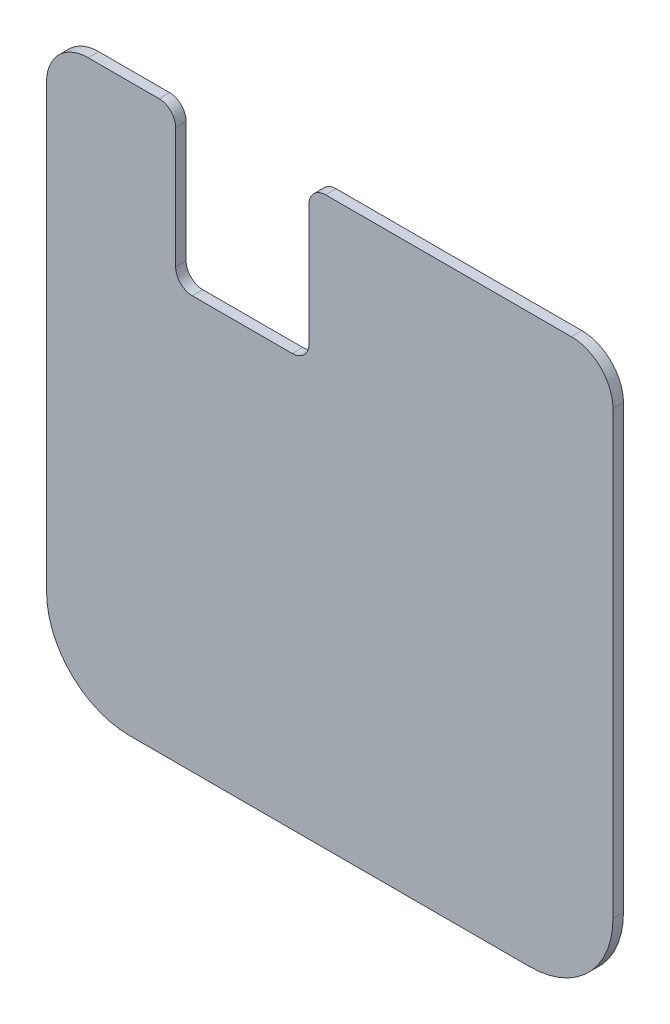
ISO-10303-21;
HEADER;
FILE_DESCRIPTION(('STEP AP214'),'2;1');
FILE_NAME('part.step','',(''),(''),'','','');
FILE_SCHEMA(('AUTOMOTIVE_DESIGN { 1 0 10303 214 1 1 1 1 }'));
ENDSEC;
DATA;
#1=APPLICATION_CONTEXT('core data for automotive mechanical design processes');
#2=APPLICATION_PROTOCOL_DEFINITION('international standard','automotive_design',2000,#1);
#3=PRODUCT_CONTEXT('',#1,'mechanical');
#4=PRODUCT('Part','Part','',(#3));
#5=PRODUCT_RELATED_PRODUCT_CATEGORY('part','',(#4));
#6=PRODUCT_DEFINITION_FORMATION('','',#4);
#7=PRODUCT_DEFINITION_CONTEXT('part definition',#1,'design');
#8=PRODUCT_DEFINITION('design','',#6,#7);
#9=PRODUCT_DEFINITION_SHAPE('','',#8);
#10=(LENGTH_UNIT() NAMED_UNIT(*) SI_UNIT(.MILLI.,.METRE.));
#11=(NAMED_UNIT(*) PLANE_ANGLE_UNIT() SI_UNIT($,.RADIAN.));
#12=(NAMED_UNIT(*) SI_UNIT($,.STERADIAN.) SOLID_ANGLE_UNIT());
#13=UNCERTAINTY_MEASURE_WITH_UNIT(LENGTH_MEASURE(1.E-05),#10,'distance_accuracy_value','');
#14=(GEOMETRIC_REPRESENTATION_CONTEXT(3) GLOBAL_UNCERTAINTY_ASSIGNED_CONTEXT((#13)) GLOBAL_UNIT_ASSIGNED_CONTEXT((#10,
#11,#12)) REPRESENTATION_CONTEXT('',''));
#15=CARTESIAN_POINT('',(0.,0.,0.));
#16=DIRECTION('',(0.,0.,1.));
#17=DIRECTION('',(1.,0.,0.));
#18=AXIS2_PLACEMENT_3D('',#15,#16,#17);
#19=CARTESIAN_POINT('',(44.1452,-26.01468,1.6002));
#20=DIRECTION('',(0.,0.,-1.));
#21=DIRECTION('',(-1.,0.,0.));
#22=AXIS2_PLACEMENT_3D('',#19,#20,#21);
#23=CYLINDRICAL_SURFACE('',#22,6.35);
#24=CARTESIAN_POINT('',(44.1452,-26.01468,0.));
#25=DIRECTION('',(0.,0.,1.));
#26=DIRECTION('',(1.,0.,0.));
#27=AXIS2_PLACEMENT_3D('',#24,#25,#26);
#28=CIRCLE('',#27,6.35);
#29=CARTESIAN_POINT('',(44.1452,-19.66468,0.));
#30=VERTEX_POINT('',#29);
#31=CARTESIAN_POINT('',(37.7952,-26.01468,0.));
#32=VERTEX_POINT('',#31);
#33=EDGE_CURVE('E180',#30,#32,#28,.T.);
#34=ORIENTED_EDGE('',*,*,#33,.T.);
#35=DIRECTION('',(0.,0.,-1.));
#36=VECTOR('',#35,1.);
#37=CARTESIAN_POINT('',(37.7952,-26.01468,1.6002));
#38=LINE('',#37,#36);
#39=CARTESIAN_POINT('',(37.7952,-26.01468,1.6002));
#40=VERTEX_POINT('',#39);
#41=EDGE_CURVE('E11',#40,#32,#38,.T.);
#42=ORIENTED_EDGE('',*,*,#41,.F.);
#43=CARTESIAN_POINT('',(44.1452,-26.01468,1.6002));
#44=DIRECTION('',(0.,0.,1.));
#45=DIRECTION('',(1.,0.,0.));
#46=AXIS2_PLACEMENT_3D('',#43,#44,#45);
#47=CIRCLE('',#46,6.35);
#48=CARTESIAN_POINT('',(44.1452,-19.66468,1.6002));
#49=VERTEX_POINT('',#48);
#50=EDGE_CURVE('E210',#49,#40,#47,.T.);
#51=ORIENTED_EDGE('',*,*,#50,.F.);
#52=DIRECTION('',(0.,0.,-1.));
#53=VECTOR('',#52,1.);
#54=CARTESIAN_POINT('',(44.1452,-19.66468,1.6002));
#55=LINE('',#54,#53);
#56=EDGE_CURVE('E176',#49,#30,#55,.T.);
#57=ORIENTED_EDGE('',*,*,#56,.T.);
#58=EDGE_LOOP('',(#34,#42,#51,#57));
#59=FACE_BOUND('',#58,.T.);
#60=ADVANCED_FACE('F36',(#59),#23,.T.);
#61=CARTESIAN_POINT('',(37.7952,-26.01468,1.6002));
#62=DIRECTION('',(1.,0.,0.));
#63=DIRECTION('',(0.,0.,-1.));
#64=AXIS2_PLACEMENT_3D('',#61,#62,#63);
#65=PLANE('',#64);
#66=DIRECTION('',(0.,-1.,0.));
#67=VECTOR('',#66,1.);
#68=CARTESIAN_POINT('',(37.7952,-26.01468,0.));
#69=LINE('',#68,#67);
#70=CARTESIAN_POINT('',(37.7952,-93.32468,0.));
#71=VERTEX_POINT('',#70);
#72=EDGE_CURVE('E183',#32,#71,#69,.T.);
#73=ORIENTED_EDGE('',*,*,#72,.T.);
#74=DIRECTION('',(0.,0.,-1.));
#75=VECTOR('',#74,1.);
#76=CARTESIAN_POINT('',(37.7952,-93.32468,1.6002));
#77=LINE('',#76,#75);
#78=CARTESIAN_POINT('',(37.7952,-93.32468,1.6002));
#79=VERTEX_POINT('',#78);
#80=EDGE_CURVE('E44',#79,#71,#77,.T.);
#81=ORIENTED_EDGE('',*,*,#80,.F.);
#82=DIRECTION('',(0.,-1.,0.));
#83=VECTOR('',#82,1.);
#84=CARTESIAN_POINT('',(37.7952,-26.01468,1.6002));
#85=LINE('',#84,#83);
#86=EDGE_CURVE('E119',#40,#79,#85,.T.);
#87=ORIENTED_EDGE('',*,*,#86,.F.);
#88=ORIENTED_EDGE('',*,*,#41,.T.);
#89=EDGE_LOOP('',(#73,#81,#87,#88));
#90=FACE_BOUND('',#89,.T.);
#91=ADVANCED_FACE('F308',(#90),#65,.F.);
#92=CARTESIAN_POINT('',(50.4952,-93.32468,1.6002));
#93=DIRECTION('',(0.,0.,-1.));
#94=DIRECTION('',(-1.,0.,0.));
#95=AXIS2_PLACEMENT_3D('',#92,#93,#94);
#96=CYLINDRICAL_SURFACE('',#95,12.7);
#97=CARTESIAN_POINT('',(50.4952,-93.32468,0.));
#98=DIRECTION('',(0.,0.,1.));
#99=DIRECTION('',(1.,0.,0.));
#100=AXIS2_PLACEMENT_3D('',#97,#98,#99);
#101=CIRCLE('',#100,12.7);
#102=CARTESIAN_POINT('',(50.4952,-106.02468,0.));
#103=VERTEX_POINT('',#102);
#104=EDGE_CURVE('E185',#71,#103,#101,.T.);
#105=ORIENTED_EDGE('',*,*,#104,.T.);
#106=DIRECTION('',(0.,0.,-1.));
#107=VECTOR('',#106,1.);
#108=CARTESIAN_POINT('',(50.4952,-106.02468,1.6002));
#109=LINE('',#108,#107);
#110=CARTESIAN_POINT('',(50.4952,-106.02468,1.6002));
#111=VERTEX_POINT('',#110);
#112=EDGE_CURVE('E241',#111,#103,#109,.T.);
#113=ORIENTED_EDGE('',*,*,#112,.F.);
#114=CARTESIAN_POINT('',(50.4952,-93.32468,1.6002));
#115=DIRECTION('',(0.,0.,1.));
#116=DIRECTION('',(1.,0.,0.));
#117=AXIS2_PLACEMENT_3D('',#114,#115,#116);
#118=CIRCLE('',#117,12.7);
#119=EDGE_CURVE('E249',#79,#111,#118,.T.);
#120=ORIENTED_EDGE('',*,*,#119,.F.);
#121=ORIENTED_EDGE('',*,*,#80,.T.);
#122=EDGE_LOOP('',(#105,#113,#120,#121));
#123=FACE_BOUND('',#122,.T.);
#124=ADVANCED_FACE('F247',(#123),#96,.T.);
#125=CARTESIAN_POINT('',(50.4952,-106.02468,1.6002));
#126=DIRECTION('',(0.,1.,0.));
#127=DIRECTION('',(0.,0.,1.));
#128=AXIS2_PLACEMENT_3D('',#125,#126,#127);
#129=PLANE('',#128);
#130=DIRECTION('',(1.,0.,0.));
#131=VECTOR('',#130,1.);
#132=CARTESIAN_POINT('',(50.4952,-106.02468,0.));
#133=LINE('',#132,#131);
#134=CARTESIAN_POINT('',(111.4552,-106.02468,0.));
#135=VERTEX_POINT('',#134);
#136=EDGE_CURVE('E187',#103,#135,#133,.T.);
#137=ORIENTED_EDGE('',*,*,#136,.T.);
#138=DIRECTION('',(0.,0.,-1.));
#139=VECTOR('',#138,1.);
#140=CARTESIAN_POINT('',(111.4552,-106.02468,1.6002));
#141=LINE('',#140,#139);
#142=CARTESIAN_POINT('',(111.4552,-106.02468,1.6002));
#143=VERTEX_POINT('',#142);
#144=EDGE_CURVE('E238',#143,#135,#141,.T.);
#145=ORIENTED_EDGE('',*,*,#144,.F.);
#146=DIRECTION('',(1.,0.,0.));
#147=VECTOR('',#146,1.);
#148=CARTESIAN_POINT('',(50.4952,-106.02468,1.6002));
#149=LINE('',#148,#147);
#150=EDGE_CURVE('E267',#111,#143,#149,.T.);
#151=ORIENTED_EDGE('',*,*,#150,.F.);
#152=ORIENTED_EDGE('',*,*,#112,.T.);
#153=EDGE_LOOP('',(#137,#145,#151,#152));
#154=FACE_BOUND('',#153,.T.);
#155=ADVANCED_FACE('F258',(#154),#129,.F.);
#156=CARTESIAN_POINT('',(111.4552,-93.32468,1.6002));
#157=DIRECTION('',(0.,0.,-1.));
#158=DIRECTION('',(-1.,0.,0.));
#159=AXIS2_PLACEMENT_3D('',#156,#157,#158);
#160=CYLINDRICAL_SURFACE('',#159,12.7);
#161=CARTESIAN_POINT('',(111.4552,-93.32468,0.));
#162=DIRECTION('',(0.,0.,1.));
#163=DIRECTION('',(1.,0.,0.));
#164=AXIS2_PLACEMENT_3D('',#161,#162,#163);
#165=CIRCLE('',#164,12.7);
#166=CARTESIAN_POINT('',(124.1552,-93.32468,0.));
#167=VERTEX_POINT('',#166);
#168=EDGE_CURVE('E189',#135,#167,#165,.T.);
#169=ORIENTED_EDGE('',*,*,#168,.T.);
#170=DIRECTION('',(0.,0.,-1.));
#171=VECTOR('',#170,1.);
#172=CARTESIAN_POINT('',(124.1552,-93.32468,1.6002));
#173=LINE('',#172,#171);
#174=CARTESIAN_POINT('',(124.1552,-93.32468,1.6002));
#175=VERTEX_POINT('',#174);
#176=EDGE_CURVE('E235',#175,#167,#173,.T.);
#177=ORIENTED_EDGE('',*,*,#176,.F.);
#178=CARTESIAN_POINT('',(111.4552,-93.32468,1.6002));
#179=DIRECTION('',(0.,0.,1.));
#180=DIRECTION('',(1.,0.,0.));
#181=AXIS2_PLACEMENT_3D('',#178,#179,#180);
#182=CIRCLE('',#181,12.7);
#183=EDGE_CURVE('E264',#143,#175,#182,.T.);
#184=ORIENTED_EDGE('',*,*,#183,.F.);
#185=ORIENTED_EDGE('',*,*,#144,.T.);
#186=EDGE_LOOP('',(#169,#177,#184,#185));
#187=FACE_BOUND('',#186,.T.);
#188=ADVANCED_FACE('F262',(#187),#160,.T.);
#189=CARTESIAN_POINT('',(124.1552,-93.32468,1.6002));
#190=DIRECTION('',(-1.,0.,0.));
#191=DIRECTION('',(0.,0.,1.));
#192=AXIS2_PLACEMENT_3D('',#189,#190,#191);
#193=PLANE('',#192);
#194=DIRECTION('',(0.,1.,0.));
#195=VECTOR('',#194,1.);
#196=CARTESIAN_POINT('',(124.1552,-93.32468,0.));
#197=LINE('',#196,#195);
#198=CARTESIAN_POINT('',(124.1552,-26.01468,0.));
#199=VERTEX_POINT('',#198);
#200=EDGE_CURVE('E191',#167,#199,#197,.T.);
#201=ORIENTED_EDGE('',*,*,#200,.T.);
#202=DIRECTION('',(0.,0.,-1.));
#203=VECTOR('',#202,1.);
#204=CARTESIAN_POINT('',(124.1552,-26.01468,1.6002));
#205=LINE('',#204,#203);
#206=CARTESIAN_POINT('',(124.1552,-26.01468,1.6002));
#207=VERTEX_POINT('',#206);
#208=EDGE_CURVE('E232',#207,#199,#205,.T.);
#209=ORIENTED_EDGE('',*,*,#208,.F.);
#210=DIRECTION('',(0.,1.,0.));
#211=VECTOR('',#210,1.);
#212=CARTESIAN_POINT('',(124.1552,-93.32468,1.6002));
#213=LINE('',#212,#211);
#214=EDGE_CURVE('E266',#175,#207,#213,.T.);
#215=ORIENTED_EDGE('',*,*,#214,.F.);
#216=ORIENTED_EDGE('',*,*,#176,.T.);
#217=EDGE_LOOP('',(#201,#209,#215,#216));
#218=FACE_BOUND('',#217,.T.);
#219=ADVANCED_FACE('F321',(#218),#193,.F.);
#220=CARTESIAN_POINT('',(117.8052,-26.01468,1.6002));
#221=DIRECTION('',(0.,0.,-1.));
#222=DIRECTION('',(-1.,0.,0.));
#223=AXIS2_PLACEMENT_3D('',#220,#221,#222);
#224=CYLINDRICAL_SURFACE('',#223,6.35);
#225=CARTESIAN_POINT('',(117.8052,-26.01468,0.));
#226=DIRECTION('',(0.,0.,1.));
#227=DIRECTION('',(1.,0.,0.));
#228=AXIS2_PLACEMENT_3D('',#225,#226,#227);
#229=CIRCLE('',#228,6.35);
#230=CARTESIAN_POINT('',(117.8052,-19.66468,0.));
#231=VERTEX_POINT('',#230);
#232=EDGE_CURVE('E193',#199,#231,#229,.T.);
#233=ORIENTED_EDGE('',*,*,#232,.T.);
#234=DIRECTION('',(0.,0.,-1.));
#235=VECTOR('',#234,1.);
#236=CARTESIAN_POINT('',(117.8052,-19.66468,1.6002));
#237=LINE('',#236,#235);
#238=CARTESIAN_POINT('',(117.8052,-19.66468,1.6002));
#239=VERTEX_POINT('',#238);
#240=EDGE_CURVE('E229',#239,#231,#237,.T.);
#241=ORIENTED_EDGE('',*,*,#240,.F.);
#242=CARTESIAN_POINT('',(117.8052,-26.01468,1.6002));
#243=DIRECTION('',(0.,0.,1.));
#244=DIRECTION('',(1.,0.,0.));
#245=AXIS2_PLACEMENT_3D('',#242,#243,#244);
#246=CIRCLE('',#245,6.35);
#247=EDGE_CURVE('E269',#207,#239,#246,.T.);
#248=ORIENTED_EDGE('',*,*,#247,.F.);
#249=ORIENTED_EDGE('',*,*,#208,.T.);
#250=EDGE_LOOP('',(#233,#241,#248,#249));
#251=FACE_BOUND('',#250,.T.);
#252=ADVANCED_FACE('F324',(#251),#224,.T.);
#253=CARTESIAN_POINT('',(117.8052,-19.66468,1.6002));
#254=DIRECTION('',(0.,-1.,0.));
#255=DIRECTION('',(0.,0.,-1.));
#256=AXIS2_PLACEMENT_3D('',#253,#254,#255);
#257=PLANE('',#256);
#258=DIRECTION('',(-1.,0.,0.));
#259=VECTOR('',#258,1.);
#260=CARTESIAN_POINT('',(117.8052,-19.66468,0.));
#261=LINE('',#260,#259);
#262=CARTESIAN_POINT('',(80.3402,-19.66468,0.));
#263=VERTEX_POINT('',#262);
#264=EDGE_CURVE('E195',#231,#263,#261,.T.);
#265=ORIENTED_EDGE('',*,*,#264,.T.);
#266=DIRECTION('',(0.,0.,-1.));
#267=VECTOR('',#266,1.);
#268=CARTESIAN_POINT('',(80.3402,-19.66468,1.6002));
#269=LINE('',#268,#267);
#270=CARTESIAN_POINT('',(80.3402,-19.66468,1.6002));
#271=VERTEX_POINT('',#270);
#272=EDGE_CURVE('E226',#271,#263,#269,.T.);
#273=ORIENTED_EDGE('',*,*,#272,.F.);
#274=DIRECTION('',(-1.,0.,0.));
#275=VECTOR('',#274,1.);
#276=CARTESIAN_POINT('',(117.8052,-19.66468,1.6002));
#277=LINE('',#276,#275);
#278=EDGE_CURVE('E275',#239,#271,#277,.T.);
#279=ORIENTED_EDGE('',*,*,#278,.F.);
#280=ORIENTED_EDGE('',*,*,#240,.T.);
#281=EDGE_LOOP('',(#265,#273,#279,#280));
#282=FACE_BOUND('',#281,.T.);
#283=ADVANCED_FACE('F328',(#282),#257,.F.);
#284=CARTESIAN_POINT('',(80.3402,-22.20468,1.6002));
#285=DIRECTION('',(0.,0.,-1.));
#286=DIRECTION('',(-1.,0.,0.));
#287=AXIS2_PLACEMENT_3D('',#284,#285,#286);
#288=CYLINDRICAL_SURFACE('',#287,2.54);
#289=CARTESIAN_POINT('',(80.3402,-22.20468,0.));
#290=DIRECTION('',(0.,0.,1.));
#291=DIRECTION('',(1.,0.,0.));
#292=AXIS2_PLACEMENT_3D('',#289,#290,#291);
#293=CIRCLE('',#292,2.54);
#294=CARTESIAN_POINT('',(77.8002,-22.20468,0.));
#295=VERTEX_POINT('',#294);
#296=EDGE_CURVE('E197',#263,#295,#293,.T.);
#297=ORIENTED_EDGE('',*,*,#296,.T.);
#298=DIRECTION('',(0.,0.,-1.));
#299=VECTOR('',#298,1.);
#300=CARTESIAN_POINT('',(77.8002,-22.20468,1.6002));
#301=LINE('',#300,#299);
#302=CARTESIAN_POINT('',(77.8002,-22.20468,1.6002));
#303=VERTEX_POINT('',#302);
#304=EDGE_CURVE('E223',#303,#295,#301,.T.);
#305=ORIENTED_EDGE('',*,*,#304,.F.);
#306=CARTESIAN_POINT('',(80.3402,-22.20468,1.6002));
#307=DIRECTION('',(0.,0.,1.));
#308=DIRECTION('',(1.,0.,0.));
#309=AXIS2_PLACEMENT_3D('',#306,#307,#308);
#310=CIRCLE('',#309,2.54);
#311=EDGE_CURVE('E277',#271,#303,#310,.T.);
#312=ORIENTED_EDGE('',*,*,#311,.F.);
#313=ORIENTED_EDGE('',*,*,#272,.T.);
#314=EDGE_LOOP('',(#297,#305,#312,#313));
#315=FACE_BOUND('',#314,.T.);
#316=ADVANCED_FACE('F332',(#315),#288,.T.);
#317=CARTESIAN_POINT('',(77.8002,-22.20468,1.6002));
#318=DIRECTION('',(1.,0.,0.));
#319=DIRECTION('',(0.,0.,-1.));
#320=AXIS2_PLACEMENT_3D('',#317,#318,#319);
#321=PLANE('',#320);
#322=DIRECTION('',(0.,-1.,0.));
#323=VECTOR('',#322,1.);
#324=CARTESIAN_POINT('',(77.8002,-22.20468,0.));
#325=LINE('',#324,#323);
#326=CARTESIAN_POINT('',(77.8002,-40.61968,0.));
#327=VERTEX_POINT('',#326);
#328=EDGE_CURVE('E199',#295,#327,#325,.T.);
#329=ORIENTED_EDGE('',*,*,#328,.T.);
#330=DIRECTION('',(0.,0.,-1.));
#331=VECTOR('',#330,1.);
#332=CARTESIAN_POINT('',(77.8002,-40.61968,1.6002));
#333=LINE('',#332,#331);
#334=CARTESIAN_POINT('',(77.8002,-40.61968,1.6002));
#335=VERTEX_POINT('',#334);
#336=EDGE_CURVE('E220',#335,#327,#333,.T.);
#337=ORIENTED_EDGE('',*,*,#336,.F.);
#338=DIRECTION('',(0.,-1.,0.));
#339=VECTOR('',#338,1.);
#340=CARTESIAN_POINT('',(77.8002,-22.20468,1.6002));
#341=LINE('',#340,#339);
#342=EDGE_CURVE('E279',#303,#335,#341,.T.);
#343=ORIENTED_EDGE('',*,*,#342,.F.);
#344=ORIENTED_EDGE('',*,*,#304,.T.);
#345=EDGE_LOOP('',(#329,#337,#343,#344));
#346=FACE_BOUND('',#345,.T.);
#347=ADVANCED_FACE('F336',(#346),#321,.F.);
#348=CARTESIAN_POINT('',(75.2602,-40.61968,1.6002));
#349=DIRECTION('',(0.,0.,-1.));
#350=DIRECTION('',(-1.,0.,0.));
#351=AXIS2_PLACEMENT_3D('',#348,#349,#350);
#352=CYLINDRICAL_SURFACE('',#351,2.54);
#353=CARTESIAN_POINT('',(75.2602,-40.61968,0.));
#354=DIRECTION('',(0.,0.,-1.));
#355=DIRECTION('',(-1.,0.,0.));
#356=AXIS2_PLACEMENT_3D('',#353,#354,#355);
#357=CIRCLE('',#356,2.54);
#358=CARTESIAN_POINT('',(75.2602,-43.15968,0.));
#359=VERTEX_POINT('',#358);
#360=EDGE_CURVE('E201',#327,#359,#357,.T.);
#361=ORIENTED_EDGE('',*,*,#360,.T.);
#362=DIRECTION('',(0.,0.,-1.));
#363=VECTOR('',#362,1.);
#364=CARTESIAN_POINT('',(75.2602,-43.15968,1.6002));
#365=LINE('',#364,#363);
#366=CARTESIAN_POINT('',(75.2602,-43.15968,1.6002));
#367=VERTEX_POINT('',#366);
#368=EDGE_CURVE('E217',#367,#359,#365,.T.);
#369=ORIENTED_EDGE('',*,*,#368,.F.);
#370=CARTESIAN_POINT('',(75.2602,-40.61968,1.6002));
#371=DIRECTION('',(0.,0.,-1.));
#372=DIRECTION('',(-1.,0.,0.));
#373=AXIS2_PLACEMENT_3D('',#370,#371,#372);
#374=CIRCLE('',#373,2.54);
#375=EDGE_CURVE('E281',#335,#367,#374,.T.);
#376=ORIENTED_EDGE('',*,*,#375,.F.);
#377=ORIENTED_EDGE('',*,*,#336,.T.);
#378=EDGE_LOOP('',(#361,#369,#376,#377));
#379=FACE_BOUND('',#378,.T.);
#380=ADVANCED_FACE('F340',(#379),#352,.F.);
#381=CARTESIAN_POINT('',(75.2602,-43.15968,1.6002));
#382=DIRECTION('',(0.,-1.,0.));
#383=DIRECTION('',(0.,0.,-1.));
#384=AXIS2_PLACEMENT_3D('',#381,#382,#383);
#385=PLANE('',#384);
#386=DIRECTION('',(-1.,0.,0.));
#387=VECTOR('',#386,1.);
#388=CARTESIAN_POINT('',(75.2602,-43.15968,0.));
#389=LINE('',#388,#387);
#390=CARTESIAN_POINT('',(60.0202,-43.15968,0.));
#391=VERTEX_POINT('',#390);
#392=EDGE_CURVE('E203',#359,#391,#389,.T.);
#393=ORIENTED_EDGE('',*,*,#392,.T.);
#394=DIRECTION('',(0.,0.,-1.));
#395=VECTOR('',#394,1.);
#396=CARTESIAN_POINT('',(60.0202,-43.15968,1.6002));
#397=LINE('',#396,#395);
#398=CARTESIAN_POINT('',(60.0202,-43.15968,1.6002));
#399=VERTEX_POINT('',#398);
#400=EDGE_CURVE('E214',#399,#391,#397,.T.);
#401=ORIENTED_EDGE('',*,*,#400,.F.);
#402=DIRECTION('',(-1.,0.,0.));
#403=VECTOR('',#402,1.);
#404=CARTESIAN_POINT('',(75.2602,-43.15968,1.6002));
#405=LINE('',#404,#403);
#406=EDGE_CURVE('E283',#367,#399,#405,.T.);
#407=ORIENTED_EDGE('',*,*,#406,.F.);
#408=ORIENTED_EDGE('',*,*,#368,.T.);
#409=EDGE_LOOP('',(#393,#401,#407,#408));
#410=FACE_BOUND('',#409,.T.);
#411=ADVANCED_FACE('F289',(#410),#385,.F.);
#412=CARTESIAN_POINT('',(60.0202,-40.61968,1.6002));
#413=DIRECTION('',(0.,0.,-1.));
#414=DIRECTION('',(-1.,0.,0.));
#415=AXIS2_PLACEMENT_3D('',#412,#413,#414);
#416=CYLINDRICAL_SURFACE('',#415,2.54);
#417=CARTESIAN_POINT('',(60.0202,-40.61968,0.));
#418=DIRECTION('',(0.,0.,-1.));
#419=DIRECTION('',(-1.,0.,0.));
#420=AXIS2_PLACEMENT_3D('',#417,#418,#419);
#421=CIRCLE('',#420,2.54);
#422=CARTESIAN_POINT('',(57.4802,-40.61968,0.));
#423=VERTEX_POINT('',#422);
#424=EDGE_CURVE('E205',#391,#423,#421,.T.);
#425=ORIENTED_EDGE('',*,*,#424,.T.);
#426=DIRECTION('',(0.,0.,-1.));
#427=VECTOR('',#426,1.);
#428=CARTESIAN_POINT('',(57.4802,-40.61968,1.6002));
#429=LINE('',#428,#427);
#430=CARTESIAN_POINT('',(57.4802,-40.61968,1.6002));
#431=VERTEX_POINT('',#430);
#432=EDGE_CURVE('E171',#431,#423,#429,.T.);
#433=ORIENTED_EDGE('',*,*,#432,.F.);
#434=CARTESIAN_POINT('',(60.0202,-40.61968,1.6002));
#435=DIRECTION('',(0.,0.,-1.));
#436=DIRECTION('',(-1.,0.,0.));
#437=AXIS2_PLACEMENT_3D('',#434,#435,#436);
#438=CIRCLE('',#437,2.54);
#439=EDGE_CURVE('E162',#399,#431,#438,.T.);
#440=ORIENTED_EDGE('',*,*,#439,.F.);
#441=ORIENTED_EDGE('',*,*,#400,.T.);
#442=EDGE_LOOP('',(#425,#433,#440,#441));
#443=FACE_BOUND('',#442,.T.);
#444=ADVANCED_FACE('F293',(#443),#416,.F.);
#445=CARTESIAN_POINT('',(57.4802,-40.61968,1.6002));
#446=DIRECTION('',(-1.,0.,0.));
#447=DIRECTION('',(0.,0.,1.));
#448=AXIS2_PLACEMENT_3D('',#445,#446,#447);
#449=PLANE('',#448);
#450=DIRECTION('',(0.,1.,0.));
#451=VECTOR('',#450,1.);
#452=CARTESIAN_POINT('',(57.4802,-40.61968,0.));
#453=LINE('',#452,#451);
#454=CARTESIAN_POINT('',(57.4802,-22.20468,0.));
#455=VERTEX_POINT('',#454);
#456=EDGE_CURVE('E170',#423,#455,#453,.T.);
#457=ORIENTED_EDGE('',*,*,#456,.T.);
#458=DIRECTION('',(0.,0.,-1.));
#459=VECTOR('',#458,1.);
#460=CARTESIAN_POINT('',(57.4802,-22.20468,1.6002));
#461=LINE('',#460,#459);
#462=CARTESIAN_POINT('',(57.4802,-22.20468,1.6002));
#463=VERTEX_POINT('',#462);
#464=EDGE_CURVE('E167',#463,#455,#461,.T.);
#465=ORIENTED_EDGE('',*,*,#464,.F.);
#466=DIRECTION('',(0.,1.,0.));
#467=VECTOR('',#466,1.);
#468=CARTESIAN_POINT('',(57.4802,-40.61968,1.6002));
#469=LINE('',#468,#467);
#470=EDGE_CURVE('E156',#431,#463,#469,.T.);
#471=ORIENTED_EDGE('',*,*,#470,.F.);
#472=ORIENTED_EDGE('',*,*,#432,.T.);
#473=EDGE_LOOP('',(#457,#465,#471,#472));
#474=FACE_BOUND('',#473,.T.);
#475=ADVANCED_FACE('F168',(#474),#449,.F.);
#476=CARTESIAN_POINT('',(54.9402,-22.20468,1.6002));
#477=DIRECTION('',(0.,0.,-1.));
#478=DIRECTION('',(-1.,0.,0.));
#479=AXIS2_PLACEMENT_3D('',#476,#477,#478);
#480=CYLINDRICAL_SURFACE('',#479,2.54);
#481=CARTESIAN_POINT('',(54.9402,-22.20468,0.));
#482=DIRECTION('',(0.,0.,1.));
#483=DIRECTION('',(1.,0.,0.));
#484=AXIS2_PLACEMENT_3D('',#481,#482,#483);
#485=CIRCLE('',#484,2.54);
#486=CARTESIAN_POINT('',(54.9402,-19.66468,0.));
#487=VERTEX_POINT('',#486);
#488=EDGE_CURVE('E105',#455,#487,#485,.T.);
#489=ORIENTED_EDGE('',*,*,#488,.T.);
#490=DIRECTION('',(0.,0.,-1.));
#491=VECTOR('',#490,1.);
#492=CARTESIAN_POINT('',(54.9402,-19.66468,1.6002));
#493=LINE('',#492,#491);
#494=CARTESIAN_POINT('',(54.9402,-19.66468,1.6002));
#495=VERTEX_POINT('',#494);
#496=EDGE_CURVE('E172',#495,#487,#493,.T.);
#497=ORIENTED_EDGE('',*,*,#496,.F.);
#498=CARTESIAN_POINT('',(54.9402,-22.20468,1.6002));
#499=DIRECTION('',(0.,0.,1.));
#500=DIRECTION('',(1.,0.,0.));
#501=AXIS2_PLACEMENT_3D('',#498,#499,#500);
#502=CIRCLE('',#501,2.54);
#503=EDGE_CURVE('E160',#463,#495,#502,.T.);
#504=ORIENTED_EDGE('',*,*,#503,.F.);
#505=ORIENTED_EDGE('',*,*,#464,.T.);
#506=EDGE_LOOP('',(#489,#497,#504,#505));
#507=FACE_BOUND('',#506,.T.);
#508=ADVANCED_FACE('F174',(#507),#480,.T.);
#509=CARTESIAN_POINT('',(54.9402,-19.66468,1.6002));
#510=DIRECTION('',(0.,-1.,0.));
#511=DIRECTION('',(0.,0.,-1.));
#512=AXIS2_PLACEMENT_3D('',#509,#510,#511);
#513=PLANE('',#512);
#514=DIRECTION('',(-1.,0.,0.));
#515=VECTOR('',#514,1.);
#516=CARTESIAN_POINT('',(54.9402,-19.66468,0.));
#517=LINE('',#516,#515);
#518=EDGE_CURVE('E111',#487,#30,#517,.T.);
#519=ORIENTED_EDGE('',*,*,#518,.T.);
#520=ORIENTED_EDGE('',*,*,#56,.F.);
#521=DIRECTION('',(-1.,0.,0.));
#522=VECTOR('',#521,1.);
#523=CARTESIAN_POINT('',(54.9402,-19.66468,1.6002));
#524=LINE('',#523,#522);
#525=EDGE_CURVE('E52',#495,#49,#524,.T.);
#526=ORIENTED_EDGE('',*,*,#525,.F.);
#527=ORIENTED_EDGE('',*,*,#496,.T.);
#528=EDGE_LOOP('',(#519,#520,#526,#527));
#529=FACE_BOUND('',#528,.T.);
#530=ADVANCED_FACE('F297',(#529),#513,.F.);
#531=CARTESIAN_POINT('',(44.1452,-26.01468,1.6002));
#532=DIRECTION('',(0.,0.,1.));
#533=DIRECTION('',(1.,0.,0.));
#534=AXIS2_PLACEMENT_3D('',#531,#532,#533);
#535=PLANE('',#534);
#536=ORIENTED_EDGE('',*,*,#50,.T.);
#537=ORIENTED_EDGE('',*,*,#86,.T.);
#538=ORIENTED_EDGE('',*,*,#119,.T.);
#539=ORIENTED_EDGE('',*,*,#150,.T.);
#540=ORIENTED_EDGE('',*,*,#183,.T.);
#541=ORIENTED_EDGE('',*,*,#214,.T.);
#542=ORIENTED_EDGE('',*,*,#247,.T.);
#543=ORIENTED_EDGE('',*,*,#278,.T.);
#544=ORIENTED_EDGE('',*,*,#311,.T.);
#545=ORIENTED_EDGE('',*,*,#342,.T.);
#546=ORIENTED_EDGE('',*,*,#375,.T.);
#547=ORIENTED_EDGE('',*,*,#406,.T.);
#548=ORIENTED_EDGE('',*,*,#439,.T.);
#549=ORIENTED_EDGE('',*,*,#470,.T.);
#550=ORIENTED_EDGE('',*,*,#503,.T.);
#551=ORIENTED_EDGE('',*,*,#525,.T.);
#552=EDGE_LOOP('',(#536,#537,#538,#539,#540,#541,#542,#543,#544,#545,#546,#547,#548,#549,#550,#551));
#553=FACE_BOUND('',#552,.T.);
#554=ADVANCED_FACE('F158',(#553),#535,.T.);
#555=CARTESIAN_POINT('',(44.1452,-26.01468,0.));
#556=DIRECTION('',(0.,0.,1.));
#557=DIRECTION('',(1.,0.,0.));
#558=AXIS2_PLACEMENT_3D('',#555,#556,#557);
#559=PLANE('',#558);
#560=ORIENTED_EDGE('',*,*,#33,.F.);
#561=ORIENTED_EDGE('',*,*,#518,.F.);
#562=ORIENTED_EDGE('',*,*,#488,.F.);
#563=ORIENTED_EDGE('',*,*,#456,.F.);
#564=ORIENTED_EDGE('',*,*,#424,.F.);
#565=ORIENTED_EDGE('',*,*,#392,.F.);
#566=ORIENTED_EDGE('',*,*,#360,.F.);
#567=ORIENTED_EDGE('',*,*,#328,.F.);
#568=ORIENTED_EDGE('',*,*,#296,.F.);
#569=ORIENTED_EDGE('',*,*,#264,.F.);
#570=ORIENTED_EDGE('',*,*,#232,.F.);
#571=ORIENTED_EDGE('',*,*,#200,.F.);
#572=ORIENTED_EDGE('',*,*,#168,.F.);
#573=ORIENTED_EDGE('',*,*,#136,.F.);
#574=ORIENTED_EDGE('',*,*,#104,.F.);
#575=ORIENTED_EDGE('',*,*,#72,.F.);
#576=EDGE_LOOP('',(#560,#561,#562,#563,#564,#565,#566,#567,#568,#569,#570,#571,#572,#573,#574,#575));
#577=FACE_BOUND('',#576,.T.);
#578=ADVANCED_FACE('F253',(#577),#559,.F.);
#579=CLOSED_SHELL('',(#60,#91,#124,#155,#188,#219,#252,#283,#316,#347,#380,#411,#444,#475,#508,
#530,#554,#578));
#580=MANIFOLD_SOLID_BREP('B2',#579);
#581=ADVANCED_BREP_SHAPE_REPRESENTATION('',(#18,#580),#14);
#582=SHAPE_DEFINITION_REPRESENTATION(#9,#581);
ENDSEC;
END-ISO-10303-21;
